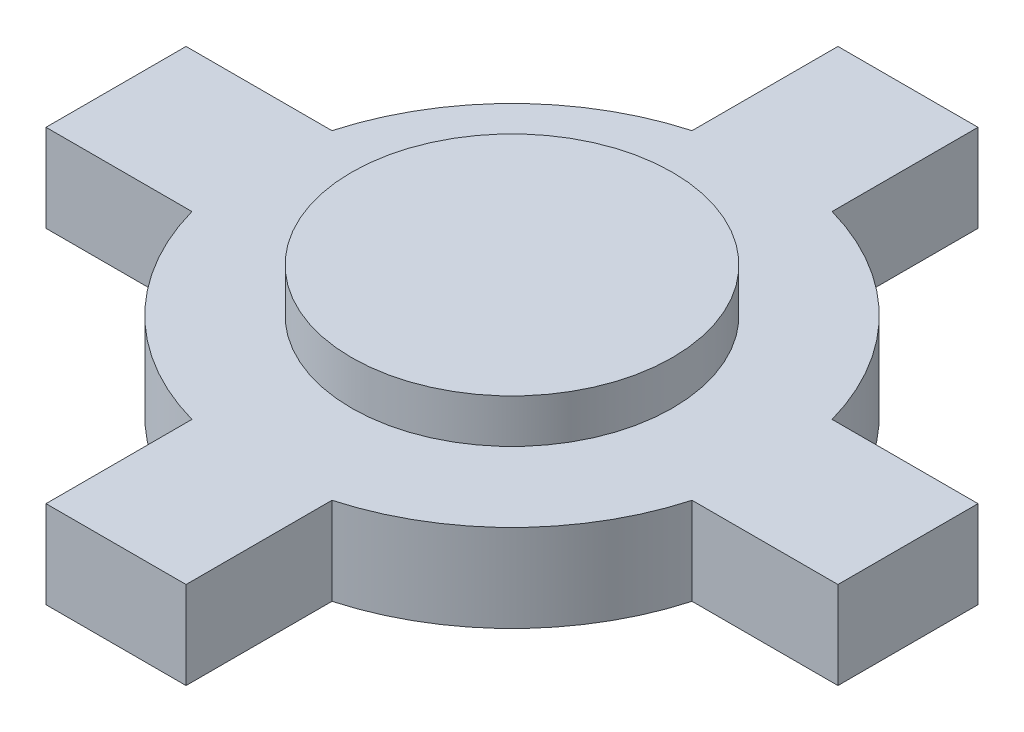
ISO-10303-21;
HEADER;
FILE_DESCRIPTION(('STEP AP214'),'2;1');
FILE_NAME('part.step','',(''),(''),'','','');
FILE_SCHEMA(('AUTOMOTIVE_DESIGN { 1 0 10303 214 1 1 1 1 }'));
ENDSEC;
DATA;
#1=APPLICATION_CONTEXT('core data for automotive mechanical design processes');
#2=APPLICATION_PROTOCOL_DEFINITION('international standard','automotive_design',2000,#1);
#3=PRODUCT_CONTEXT('',#1,'mechanical');
#4=PRODUCT('Part','Part','',(#3));
#5=PRODUCT_RELATED_PRODUCT_CATEGORY('part','',(#4));
#6=PRODUCT_DEFINITION_FORMATION('','',#4);
#7=PRODUCT_DEFINITION_CONTEXT('part definition',#1,'design');
#8=PRODUCT_DEFINITION('design','',#6,#7);
#9=PRODUCT_DEFINITION_SHAPE('','',#8);
#10=(LENGTH_UNIT() NAMED_UNIT(*) SI_UNIT(.MILLI.,.METRE.));
#11=(NAMED_UNIT(*) PLANE_ANGLE_UNIT() SI_UNIT($,.RADIAN.));
#12=(NAMED_UNIT(*) SI_UNIT($,.STERADIAN.) SOLID_ANGLE_UNIT());
#13=UNCERTAINTY_MEASURE_WITH_UNIT(LENGTH_MEASURE(1.E-05),#10,'distance_accuracy_value','');
#14=(GEOMETRIC_REPRESENTATION_CONTEXT(3) GLOBAL_UNCERTAINTY_ASSIGNED_CONTEXT((#13)) GLOBAL_UNIT_ASSIGNED_CONTEXT((#10,
#11,#12)) REPRESENTATION_CONTEXT('',''));
#15=CARTESIAN_POINT('',(0.,0.,0.));
#16=DIRECTION('',(0.,0.,1.));
#17=DIRECTION('',(1.,0.,0.));
#18=AXIS2_PLACEMENT_3D('',#15,#16,#17);
#19=CARTESIAN_POINT('',(-13.5702975444263,3.,-2.4));
#20=DIRECTION('',(1.,0.,0.));
#21=DIRECTION('',(0.,0.,-1.));
#22=AXIS2_PLACEMENT_3D('',#19,#20,#21);
#23=PLANE('',#22);
#24=DIRECTION('',(0.,0.,1.));
#25=VECTOR('',#24,1.);
#26=CARTESIAN_POINT('',(-13.5702975444263,0.,-2.4));
#27=LINE('',#26,#25);
#28=CARTESIAN_POINT('',(-13.5702975444263,0.,-2.4));
#29=VERTEX_POINT('',#28);
#30=CARTESIAN_POINT('',(-13.5702975444263,0.,2.4));
#31=VERTEX_POINT('',#30);
#32=EDGE_CURVE('E187',#29,#31,#27,.T.);
#33=ORIENTED_EDGE('',*,*,#32,.T.);
#34=DIRECTION('',(0.,-1.,0.));
#35=VECTOR('',#34,1.);
#36=CARTESIAN_POINT('',(-13.5702975444263,3.,2.4));
#37=LINE('',#36,#35);
#38=CARTESIAN_POINT('',(-13.5702975444263,3.,2.4));
#39=VERTEX_POINT('',#38);
#40=EDGE_CURVE('E44',#39,#31,#37,.T.);
#41=ORIENTED_EDGE('',*,*,#40,.F.);
#42=DIRECTION('',(0.,0.,1.));
#43=VECTOR('',#42,1.);
#44=CARTESIAN_POINT('',(-13.5702975444263,3.,-2.4));
#45=LINE('',#44,#43);
#46=CARTESIAN_POINT('',(-13.5702975444263,3.,-2.4));
#47=VERTEX_POINT('',#46);
#48=EDGE_CURVE('E218',#47,#39,#45,.T.);
#49=ORIENTED_EDGE('',*,*,#48,.F.);
#50=DIRECTION('',(0.,-1.,0.));
#51=VECTOR('',#50,1.);
#52=CARTESIAN_POINT('',(-13.5702975444263,3.,-2.4));
#53=LINE('',#52,#51);
#54=EDGE_CURVE('E183',#47,#29,#53,.T.);
#55=ORIENTED_EDGE('',*,*,#54,.T.);
#56=EDGE_LOOP('',(#33,#41,#49,#55));
#57=FACE_BOUND('',#56,.T.);
#58=ADVANCED_FACE('F41',(#57),#23,.F.);
#59=CARTESIAN_POINT('',(-13.5702975444263,3.,2.4));
#60=DIRECTION('',(0.,0.,-1.));
#61=DIRECTION('',(-1.,0.,0.));
#62=AXIS2_PLACEMENT_3D('',#59,#60,#61);
#63=PLANE('',#62);
#64=DIRECTION('',(1.,0.,0.));
#65=VECTOR('',#64,1.);
#66=CARTESIAN_POINT('',(-13.5702975444263,0.,2.4));
#67=LINE('',#66,#65);
#68=CARTESIAN_POINT('',(-8.57029754442633,0.,2.4));
#69=VERTEX_POINT('',#68);
#70=EDGE_CURVE('E190',#31,#69,#67,.T.);
#71=ORIENTED_EDGE('',*,*,#70,.T.);
#72=DIRECTION('',(0.,-1.,0.));
#73=VECTOR('',#72,1.);
#74=CARTESIAN_POINT('',(-8.57029754442633,3.,2.4));
#75=LINE('',#74,#73);
#76=CARTESIAN_POINT('',(-8.57029754442633,3.,2.4));
#77=VERTEX_POINT('',#76);
#78=EDGE_CURVE('E251',#77,#69,#75,.T.);
#79=ORIENTED_EDGE('',*,*,#78,.F.);
#80=DIRECTION('',(1.,0.,0.));
#81=VECTOR('',#80,1.);
#82=CARTESIAN_POINT('',(-13.5702975444263,3.,2.4));
#83=LINE('',#82,#81);
#84=EDGE_CURVE('E126',#39,#77,#83,.T.);
#85=ORIENTED_EDGE('',*,*,#84,.F.);
#86=ORIENTED_EDGE('',*,*,#40,.T.);
#87=EDGE_LOOP('',(#71,#79,#85,#86));
#88=FACE_BOUND('',#87,.T.);
#89=ADVANCED_FACE('F257',(#88),#63,.F.);
#90=CARTESIAN_POINT('',(0.,3.,0.));
#91=DIRECTION('',(0.,-1.,0.));
#92=DIRECTION('',(0.,0.,-1.));
#93=AXIS2_PLACEMENT_3D('',#90,#91,#92);
#94=CYLINDRICAL_SURFACE('',#93,8.9);
#95=CARTESIAN_POINT('',(0.,0.,0.));
#96=DIRECTION('',(0.,1.,0.));
#97=DIRECTION('',(0.,0.,1.));
#98=AXIS2_PLACEMENT_3D('',#95,#96,#97);
#99=CIRCLE('',#98,8.9);
#100=CARTESIAN_POINT('',(-2.39999999999999,0.,8.57029754442633));
#101=VERTEX_POINT('',#100);
#102=EDGE_CURVE('E193',#69,#101,#99,.T.);
#103=ORIENTED_EDGE('',*,*,#102,.T.);
#104=DIRECTION('',(0.,-1.,0.));
#105=VECTOR('',#104,1.);
#106=CARTESIAN_POINT('',(-2.39999999999999,3.,8.57029754442633));
#107=LINE('',#106,#105);
#108=CARTESIAN_POINT('',(-2.39999999999999,3.,8.57029754442633));
#109=VERTEX_POINT('',#108);
#110=EDGE_CURVE('E249',#109,#101,#107,.T.);
#111=ORIENTED_EDGE('',*,*,#110,.F.);
#112=CARTESIAN_POINT('',(0.,3.,0.));
#113=DIRECTION('',(0.,1.,0.));
#114=DIRECTION('',(0.,0.,1.));
#115=AXIS2_PLACEMENT_3D('',#112,#113,#114);
#116=CIRCLE('',#115,8.9);
#117=EDGE_CURVE('E274',#77,#109,#116,.T.);
#118=ORIENTED_EDGE('',*,*,#117,.F.);
#119=ORIENTED_EDGE('',*,*,#78,.T.);
#120=EDGE_LOOP('',(#103,#111,#118,#119));
#121=FACE_BOUND('',#120,.T.);
#122=ADVANCED_FACE('F266',(#121),#94,.T.);
#123=CARTESIAN_POINT('',(-2.39999999999999,3.,8.57029754442633));
#124=DIRECTION('',(1.,0.,0.));
#125=DIRECTION('',(0.,0.,-1.));
#126=AXIS2_PLACEMENT_3D('',#123,#124,#125);
#127=PLANE('',#126);
#128=DIRECTION('',(0.,0.,1.));
#129=VECTOR('',#128,1.);
#130=CARTESIAN_POINT('',(-2.39999999999999,0.,8.57029754442633));
#131=LINE('',#130,#129);
#132=CARTESIAN_POINT('',(-2.4,0.,13.5702975444263));
#133=VERTEX_POINT('',#132);
#134=EDGE_CURVE('E195',#101,#133,#131,.T.);
#135=ORIENTED_EDGE('',*,*,#134,.T.);
#136=DIRECTION('',(0.,-1.,0.));
#137=VECTOR('',#136,1.);
#138=CARTESIAN_POINT('',(-2.4,3.,13.5702975444263));
#139=LINE('',#138,#137);
#140=CARTESIAN_POINT('',(-2.4,3.,13.5702975444263));
#141=VERTEX_POINT('',#140);
#142=EDGE_CURVE('E246',#141,#133,#139,.T.);
#143=ORIENTED_EDGE('',*,*,#142,.F.);
#144=DIRECTION('',(0.,0.,1.));
#145=VECTOR('',#144,1.);
#146=CARTESIAN_POINT('',(-2.39999999999999,3.,8.57029754442633));
#147=LINE('',#146,#145);
#148=EDGE_CURVE('E271',#109,#141,#147,.T.);
#149=ORIENTED_EDGE('',*,*,#148,.F.);
#150=ORIENTED_EDGE('',*,*,#110,.T.);
#151=EDGE_LOOP('',(#135,#143,#149,#150));
#152=FACE_BOUND('',#151,.T.);
#153=ADVANCED_FACE('F269',(#152),#127,.F.);
#154=CARTESIAN_POINT('',(-2.4,3.,13.5702975444263));
#155=DIRECTION('',(0.,0.,-1.));
#156=DIRECTION('',(-1.,0.,0.));
#157=AXIS2_PLACEMENT_3D('',#154,#155,#156);
#158=PLANE('',#157);
#159=DIRECTION('',(1.,0.,0.));
#160=VECTOR('',#159,1.);
#161=CARTESIAN_POINT('',(-2.4,0.,13.5702975444263));
#162=LINE('',#161,#160);
#163=CARTESIAN_POINT('',(2.4,0.,13.5702975444263));
#164=VERTEX_POINT('',#163);
#165=EDGE_CURVE('E197',#133,#164,#162,.T.);
#166=ORIENTED_EDGE('',*,*,#165,.T.);
#167=DIRECTION('',(0.,-1.,0.));
#168=VECTOR('',#167,1.);
#169=CARTESIAN_POINT('',(2.4,3.,13.5702975444263));
#170=LINE('',#169,#168);
#171=CARTESIAN_POINT('',(2.4,3.,13.5702975444263));
#172=VERTEX_POINT('',#171);
#173=EDGE_CURVE('E243',#172,#164,#170,.T.);
#174=ORIENTED_EDGE('',*,*,#173,.F.);
#175=DIRECTION('',(1.,0.,0.));
#176=VECTOR('',#175,1.);
#177=CARTESIAN_POINT('',(-2.4,3.,13.5702975444263));
#178=LINE('',#177,#176);
#179=EDGE_CURVE('E273',#141,#172,#178,.T.);
#180=ORIENTED_EDGE('',*,*,#179,.F.);
#181=ORIENTED_EDGE('',*,*,#142,.T.);
#182=EDGE_LOOP('',(#166,#174,#180,#181));
#183=FACE_BOUND('',#182,.T.);
#184=ADVANCED_FACE('F333',(#183),#158,.F.);
#185=CARTESIAN_POINT('',(2.39999999999999,3.,8.57029754442633));
#186=DIRECTION('',(-1.,0.,0.));
#187=DIRECTION('',(0.,0.,1.));
#188=AXIS2_PLACEMENT_3D('',#185,#186,#187);
#189=PLANE('',#188);
#190=DIRECTION('',(0.,0.,-1.));
#191=VECTOR('',#190,1.);
#192=CARTESIAN_POINT('',(2.39999999999999,0.,8.57029754442633));
#193=LINE('',#192,#191);
#194=CARTESIAN_POINT('',(2.39999999999999,0.,8.57029754442633));
#195=VERTEX_POINT('',#194);
#196=EDGE_CURVE('E199',#164,#195,#193,.T.);
#197=ORIENTED_EDGE('',*,*,#196,.T.);
#198=DIRECTION('',(0.,-1.,0.));
#199=VECTOR('',#198,1.);
#200=CARTESIAN_POINT('',(2.39999999999999,3.,8.57029754442633));
#201=LINE('',#200,#199);
#202=CARTESIAN_POINT('',(2.39999999999999,3.,8.57029754442633));
#203=VERTEX_POINT('',#202);
#204=EDGE_CURVE('E240',#203,#195,#201,.T.);
#205=ORIENTED_EDGE('',*,*,#204,.F.);
#206=DIRECTION('',(0.,0.,-1.));
#207=VECTOR('',#206,1.);
#208=CARTESIAN_POINT('',(2.39999999999999,3.,8.57029754442633));
#209=LINE('',#208,#207);
#210=EDGE_CURVE('E276',#172,#203,#209,.T.);
#211=ORIENTED_EDGE('',*,*,#210,.F.);
#212=ORIENTED_EDGE('',*,*,#173,.T.);
#213=EDGE_LOOP('',(#197,#205,#211,#212));
#214=FACE_BOUND('',#213,.T.);
#215=ADVANCED_FACE('F330',(#214),#189,.F.);
#216=CARTESIAN_POINT('',(0.,3.,0.));
#217=DIRECTION('',(0.,-1.,0.));
#218=DIRECTION('',(0.,0.,-1.));
#219=AXIS2_PLACEMENT_3D('',#216,#217,#218);
#220=CYLINDRICAL_SURFACE('',#219,8.9);
#221=CARTESIAN_POINT('',(0.,0.,0.));
#222=DIRECTION('',(0.,1.,0.));
#223=DIRECTION('',(0.,0.,1.));
#224=AXIS2_PLACEMENT_3D('',#221,#222,#223);
#225=CIRCLE('',#224,8.9);
#226=CARTESIAN_POINT('',(8.57029754442633,0.,2.4));
#227=VERTEX_POINT('',#226);
#228=EDGE_CURVE('E201',#195,#227,#225,.T.);
#229=ORIENTED_EDGE('',*,*,#228,.T.);
#230=DIRECTION('',(0.,-1.,0.));
#231=VECTOR('',#230,1.);
#232=CARTESIAN_POINT('',(8.57029754442633,3.,2.4));
#233=LINE('',#232,#231);
#234=CARTESIAN_POINT('',(8.57029754442633,3.,2.4));
#235=VERTEX_POINT('',#234);
#236=EDGE_CURVE('E237',#235,#227,#233,.T.);
#237=ORIENTED_EDGE('',*,*,#236,.F.);
#238=CARTESIAN_POINT('',(0.,3.,0.));
#239=DIRECTION('',(0.,1.,0.));
#240=DIRECTION('',(0.,0.,1.));
#241=AXIS2_PLACEMENT_3D('',#238,#239,#240);
#242=CIRCLE('',#241,8.9);
#243=EDGE_CURVE('E282',#203,#235,#242,.T.);
#244=ORIENTED_EDGE('',*,*,#243,.F.);
#245=ORIENTED_EDGE('',*,*,#204,.T.);
#246=EDGE_LOOP('',(#229,#237,#244,#245));
#247=FACE_BOUND('',#246,.T.);
#248=ADVANCED_FACE('F326',(#247),#220,.T.);
#249=CARTESIAN_POINT('',(8.57029754442633,3.,2.4));
#250=DIRECTION('',(0.,0.,-1.));
#251=DIRECTION('',(-1.,0.,0.));
#252=AXIS2_PLACEMENT_3D('',#249,#250,#251);
#253=PLANE('',#252);
#254=DIRECTION('',(1.,0.,0.));
#255=VECTOR('',#254,1.);
#256=CARTESIAN_POINT('',(8.57029754442633,0.,2.4));
#257=LINE('',#256,#255);
#258=CARTESIAN_POINT('',(13.5702975444263,0.,2.4));
#259=VERTEX_POINT('',#258);
#260=EDGE_CURVE('E203',#227,#259,#257,.T.);
#261=ORIENTED_EDGE('',*,*,#260,.T.);
#262=DIRECTION('',(0.,-1.,0.));
#263=VECTOR('',#262,1.);
#264=CARTESIAN_POINT('',(13.5702975444263,3.,2.4));
#265=LINE('',#264,#263);
#266=CARTESIAN_POINT('',(13.5702975444263,3.,2.4));
#267=VERTEX_POINT('',#266);
#268=EDGE_CURVE('E234',#267,#259,#265,.T.);
#269=ORIENTED_EDGE('',*,*,#268,.F.);
#270=DIRECTION('',(1.,0.,0.));
#271=VECTOR('',#270,1.);
#272=CARTESIAN_POINT('',(8.57029754442633,3.,2.4));
#273=LINE('',#272,#271);
#274=EDGE_CURVE('E284',#235,#267,#273,.T.);
#275=ORIENTED_EDGE('',*,*,#274,.F.);
#276=ORIENTED_EDGE('',*,*,#236,.T.);
#277=EDGE_LOOP('',(#261,#269,#275,#276));
#278=FACE_BOUND('',#277,.T.);
#279=ADVANCED_FACE('F321',(#278),#253,.F.);
#280=CARTESIAN_POINT('',(13.5702975444263,3.,-2.4));
#281=DIRECTION('',(-1.,0.,0.));
#282=DIRECTION('',(0.,0.,1.));
#283=AXIS2_PLACEMENT_3D('',#280,#281,#282);
#284=PLANE('',#283);
#285=DIRECTION('',(0.,0.,-1.));
#286=VECTOR('',#285,1.);
#287=CARTESIAN_POINT('',(13.5702975444263,0.,-2.4));
#288=LINE('',#287,#286);
#289=CARTESIAN_POINT('',(13.5702975444263,0.,-2.4));
#290=VERTEX_POINT('',#289);
#291=EDGE_CURVE('E205',#259,#290,#288,.T.);
#292=ORIENTED_EDGE('',*,*,#291,.T.);
#293=DIRECTION('',(0.,-1.,0.));
#294=VECTOR('',#293,1.);
#295=CARTESIAN_POINT('',(13.5702975444263,3.,-2.4));
#296=LINE('',#295,#294);
#297=CARTESIAN_POINT('',(13.5702975444263,3.,-2.4));
#298=VERTEX_POINT('',#297);
#299=EDGE_CURVE('E231',#298,#290,#296,.T.);
#300=ORIENTED_EDGE('',*,*,#299,.F.);
#301=DIRECTION('',(0.,0.,-1.));
#302=VECTOR('',#301,1.);
#303=CARTESIAN_POINT('',(13.5702975444263,3.,-2.4));
#304=LINE('',#303,#302);
#305=EDGE_CURVE('E286',#267,#298,#304,.T.);
#306=ORIENTED_EDGE('',*,*,#305,.F.);
#307=ORIENTED_EDGE('',*,*,#268,.T.);
#308=EDGE_LOOP('',(#292,#300,#306,#307));
#309=FACE_BOUND('',#308,.T.);
#310=ADVANCED_FACE('F315',(#309),#284,.F.);
#311=CARTESIAN_POINT('',(8.57029754442633,3.,-2.4));
#312=DIRECTION('',(0.,0.,1.));
#313=DIRECTION('',(1.,0.,0.));
#314=AXIS2_PLACEMENT_3D('',#311,#312,#313);
#315=PLANE('',#314);
#316=DIRECTION('',(-1.,0.,0.));
#317=VECTOR('',#316,1.);
#318=CARTESIAN_POINT('',(8.57029754442633,0.,-2.4));
#319=LINE('',#318,#317);
#320=CARTESIAN_POINT('',(8.57029754442633,0.,-2.4));
#321=VERTEX_POINT('',#320);
#322=EDGE_CURVE('E207',#290,#321,#319,.T.);
#323=ORIENTED_EDGE('',*,*,#322,.T.);
#324=DIRECTION('',(0.,-1.,0.));
#325=VECTOR('',#324,1.);
#326=CARTESIAN_POINT('',(8.57029754442633,3.,-2.4));
#327=LINE('',#326,#325);
#328=CARTESIAN_POINT('',(8.57029754442633,3.,-2.4));
#329=VERTEX_POINT('',#328);
#330=EDGE_CURVE('E228',#329,#321,#327,.T.);
#331=ORIENTED_EDGE('',*,*,#330,.F.);
#332=DIRECTION('',(-1.,0.,0.));
#333=VECTOR('',#332,1.);
#334=CARTESIAN_POINT('',(8.57029754442633,3.,-2.4));
#335=LINE('',#334,#333);
#336=EDGE_CURVE('E288',#298,#329,#335,.T.);
#337=ORIENTED_EDGE('',*,*,#336,.F.);
#338=ORIENTED_EDGE('',*,*,#299,.T.);
#339=EDGE_LOOP('',(#323,#331,#337,#338));
#340=FACE_BOUND('',#339,.T.);
#341=ADVANCED_FACE('F311',(#340),#315,.F.);
#342=CARTESIAN_POINT('',(0.,3.,0.));
#343=DIRECTION('',(0.,-1.,0.));
#344=DIRECTION('',(0.,0.,-1.));
#345=AXIS2_PLACEMENT_3D('',#342,#343,#344);
#346=CYLINDRICAL_SURFACE('',#345,8.9);
#347=CARTESIAN_POINT('',(0.,0.,0.));
#348=DIRECTION('',(0.,1.,0.));
#349=DIRECTION('',(0.,0.,1.));
#350=AXIS2_PLACEMENT_3D('',#347,#348,#349);
#351=CIRCLE('',#350,8.9);
#352=CARTESIAN_POINT('',(2.4,0.,-8.57029754442633));
#353=VERTEX_POINT('',#352);
#354=EDGE_CURVE('E209',#321,#353,#351,.T.);
#355=ORIENTED_EDGE('',*,*,#354,.T.);
#356=DIRECTION('',(0.,-1.,0.));
#357=VECTOR('',#356,1.);
#358=CARTESIAN_POINT('',(2.4,3.,-8.57029754442633));
#359=LINE('',#358,#357);
#360=CARTESIAN_POINT('',(2.4,3.,-8.57029754442633));
#361=VERTEX_POINT('',#360);
#362=EDGE_CURVE('E225',#361,#353,#359,.T.);
#363=ORIENTED_EDGE('',*,*,#362,.F.);
#364=CARTESIAN_POINT('',(0.,3.,0.));
#365=DIRECTION('',(0.,1.,0.));
#366=DIRECTION('',(0.,0.,1.));
#367=AXIS2_PLACEMENT_3D('',#364,#365,#366);
#368=CIRCLE('',#367,8.9);
#369=EDGE_CURVE('E290',#329,#361,#368,.T.);
#370=ORIENTED_EDGE('',*,*,#369,.F.);
#371=ORIENTED_EDGE('',*,*,#330,.T.);
#372=EDGE_LOOP('',(#355,#363,#370,#371));
#373=FACE_BOUND('',#372,.T.);
#374=ADVANCED_FACE('F307',(#373),#346,.T.);
#375=CARTESIAN_POINT('',(2.4,3.,-13.5702975444263));
#376=DIRECTION('',(-1.,0.,0.));
#377=DIRECTION('',(0.,0.,1.));
#378=AXIS2_PLACEMENT_3D('',#375,#376,#377);
#379=PLANE('',#378);
#380=DIRECTION('',(0.,0.,-1.));
#381=VECTOR('',#380,1.);
#382=CARTESIAN_POINT('',(2.4,0.,-13.5702975444263));
#383=LINE('',#382,#381);
#384=CARTESIAN_POINT('',(2.4,0.,-13.5702975444263));
#385=VERTEX_POINT('',#384);
#386=EDGE_CURVE('E211',#353,#385,#383,.T.);
#387=ORIENTED_EDGE('',*,*,#386,.T.);
#388=DIRECTION('',(0.,-1.,0.));
#389=VECTOR('',#388,1.);
#390=CARTESIAN_POINT('',(2.4,3.,-13.5702975444263));
#391=LINE('',#390,#389);
#392=CARTESIAN_POINT('',(2.4,3.,-13.5702975444263));
#393=VERTEX_POINT('',#392);
#394=EDGE_CURVE('E222',#393,#385,#391,.T.);
#395=ORIENTED_EDGE('',*,*,#394,.F.);
#396=DIRECTION('',(0.,0.,-1.));
#397=VECTOR('',#396,1.);
#398=CARTESIAN_POINT('',(2.4,3.,-13.5702975444263));
#399=LINE('',#398,#397);
#400=EDGE_CURVE('E292',#361,#393,#399,.T.);
#401=ORIENTED_EDGE('',*,*,#400,.F.);
#402=ORIENTED_EDGE('',*,*,#362,.T.);
#403=EDGE_LOOP('',(#387,#395,#401,#402));
#404=FACE_BOUND('',#403,.T.);
#405=ADVANCED_FACE('F298',(#404),#379,.F.);
#406=CARTESIAN_POINT('',(-2.4,3.,-13.5702975444263));
#407=DIRECTION('',(0.,0.,1.));
#408=DIRECTION('',(1.,0.,0.));
#409=AXIS2_PLACEMENT_3D('',#406,#407,#408);
#410=PLANE('',#409);
#411=DIRECTION('',(-1.,0.,0.));
#412=VECTOR('',#411,1.);
#413=CARTESIAN_POINT('',(-2.4,0.,-13.5702975444263));
#414=LINE('',#413,#412);
#415=CARTESIAN_POINT('',(-2.4,0.,-13.5702975444263));
#416=VERTEX_POINT('',#415);
#417=EDGE_CURVE('E213',#385,#416,#414,.T.);
#418=ORIENTED_EDGE('',*,*,#417,.T.);
#419=DIRECTION('',(0.,-1.,0.));
#420=VECTOR('',#419,1.);
#421=CARTESIAN_POINT('',(-2.4,3.,-13.5702975444263));
#422=LINE('',#421,#420);
#423=CARTESIAN_POINT('',(-2.4,3.,-13.5702975444263));
#424=VERTEX_POINT('',#423);
#425=EDGE_CURVE('E178',#424,#416,#422,.T.);
#426=ORIENTED_EDGE('',*,*,#425,.F.);
#427=DIRECTION('',(-1.,0.,0.));
#428=VECTOR('',#427,1.);
#429=CARTESIAN_POINT('',(-2.4,3.,-13.5702975444263));
#430=LINE('',#429,#428);
#431=EDGE_CURVE('E169',#393,#424,#430,.T.);
#432=ORIENTED_EDGE('',*,*,#431,.F.);
#433=ORIENTED_EDGE('',*,*,#394,.T.);
#434=EDGE_LOOP('',(#418,#426,#432,#433));
#435=FACE_BOUND('',#434,.T.);
#436=ADVANCED_FACE('F302',(#435),#410,.F.);
#437=CARTESIAN_POINT('',(-2.4,3.,-13.5702975444263));
#438=DIRECTION('',(1.,0.,0.));
#439=DIRECTION('',(0.,0.,-1.));
#440=AXIS2_PLACEMENT_3D('',#437,#438,#439);
#441=PLANE('',#440);
#442=DIRECTION('',(0.,0.,1.));
#443=VECTOR('',#442,1.);
#444=CARTESIAN_POINT('',(-2.4,0.,-13.5702975444263));
#445=LINE('',#444,#443);
#446=CARTESIAN_POINT('',(-2.4,0.,-8.57029754442633));
#447=VERTEX_POINT('',#446);
#448=EDGE_CURVE('E177',#416,#447,#445,.T.);
#449=ORIENTED_EDGE('',*,*,#448,.T.);
#450=DIRECTION('',(0.,-1.,0.));
#451=VECTOR('',#450,1.);
#452=CARTESIAN_POINT('',(-2.4,3.,-8.57029754442633));
#453=LINE('',#452,#451);
#454=CARTESIAN_POINT('',(-2.4,3.,-8.57029754442633));
#455=VERTEX_POINT('',#454);
#456=EDGE_CURVE('E174',#455,#447,#453,.T.);
#457=ORIENTED_EDGE('',*,*,#456,.F.);
#458=DIRECTION('',(0.,0.,1.));
#459=VECTOR('',#458,1.);
#460=CARTESIAN_POINT('',(-2.4,3.,-13.5702975444263));
#461=LINE('',#460,#459);
#462=EDGE_CURVE('E163',#424,#455,#461,.T.);
#463=ORIENTED_EDGE('',*,*,#462,.F.);
#464=ORIENTED_EDGE('',*,*,#425,.T.);
#465=EDGE_LOOP('',(#449,#457,#463,#464));
#466=FACE_BOUND('',#465,.T.);
#467=ADVANCED_FACE('F175',(#466),#441,.F.);
#468=CARTESIAN_POINT('',(0.,3.,0.));
#469=DIRECTION('',(0.,-1.,0.));
#470=DIRECTION('',(0.,0.,-1.));
#471=AXIS2_PLACEMENT_3D('',#468,#469,#470);
#472=CYLINDRICAL_SURFACE('',#471,8.9);
#473=CARTESIAN_POINT('',(0.,0.,0.));
#474=DIRECTION('',(0.,1.,0.));
#475=DIRECTION('',(0.,0.,1.));
#476=AXIS2_PLACEMENT_3D('',#473,#474,#475);
#477=CIRCLE('',#476,8.9);
#478=CARTESIAN_POINT('',(-8.57029754442633,0.,-2.4));
#479=VERTEX_POINT('',#478);
#480=EDGE_CURVE('E111',#447,#479,#477,.T.);
#481=ORIENTED_EDGE('',*,*,#480,.T.);
#482=DIRECTION('',(0.,-1.,0.));
#483=VECTOR('',#482,1.);
#484=CARTESIAN_POINT('',(-8.57029754442633,3.,-2.4));
#485=LINE('',#484,#483);
#486=CARTESIAN_POINT('',(-8.57029754442633,3.,-2.4));
#487=VERTEX_POINT('',#486);
#488=EDGE_CURVE('E179',#487,#479,#485,.T.);
#489=ORIENTED_EDGE('',*,*,#488,.F.);
#490=CARTESIAN_POINT('',(0.,3.,0.));
#491=DIRECTION('',(0.,1.,0.));
#492=DIRECTION('',(0.,0.,1.));
#493=AXIS2_PLACEMENT_3D('',#490,#491,#492);
#494=CIRCLE('',#493,8.9);
#495=EDGE_CURVE('E167',#455,#487,#494,.T.);
#496=ORIENTED_EDGE('',*,*,#495,.F.);
#497=ORIENTED_EDGE('',*,*,#456,.T.);
#498=EDGE_LOOP('',(#481,#489,#496,#497));
#499=FACE_BOUND('',#498,.T.);
#500=ADVANCED_FACE('F181',(#499),#472,.T.);
#501=CARTESIAN_POINT('',(-13.5702975444263,3.,-2.4));
#502=DIRECTION('',(0.,0.,1.));
#503=DIRECTION('',(1.,0.,0.));
#504=AXIS2_PLACEMENT_3D('',#501,#502,#503);
#505=PLANE('',#504);
#506=DIRECTION('',(-1.,0.,0.));
#507=VECTOR('',#506,1.);
#508=CARTESIAN_POINT('',(-13.5702975444263,0.,-2.4));
#509=LINE('',#508,#507);
#510=EDGE_CURVE('E117',#479,#29,#509,.T.);
#511=ORIENTED_EDGE('',*,*,#510,.T.);
#512=ORIENTED_EDGE('',*,*,#54,.F.);
#513=DIRECTION('',(-1.,0.,0.));
#514=VECTOR('',#513,1.);
#515=CARTESIAN_POINT('',(-13.5702975444263,3.,-2.4));
#516=LINE('',#515,#514);
#517=EDGE_CURVE('E58',#487,#47,#516,.T.);
#518=ORIENTED_EDGE('',*,*,#517,.F.);
#519=ORIENTED_EDGE('',*,*,#488,.T.);
#520=EDGE_LOOP('',(#511,#512,#518,#519));
#521=FACE_BOUND('',#520,.T.);
#522=ADVANCED_FACE('F417',(#521),#505,.F.);
#523=CARTESIAN_POINT('',(0.,3.,0.));
#524=DIRECTION('',(0.,1.,0.));
#525=DIRECTION('',(0.,0.,1.));
#526=AXIS2_PLACEMENT_3D('',#523,#524,#525);
#527=PLANE('',#526);
#528=CARTESIAN_POINT('',(0.,3.,0.));
#529=DIRECTION('',(0.,1.,0.));
#530=DIRECTION('',(0.,0.,1.));
#531=AXIS2_PLACEMENT_3D('',#528,#529,#530);
#532=CIRCLE('',#531,5.5);
#533=CARTESIAN_POINT('',(0.,3.,5.5));
#534=VERTEX_POINT('',#533);
#535=EDGE_CURVE('E11',#534,#534,#532,.T.);
#536=ORIENTED_EDGE('',*,*,#535,.F.);
#537=EDGE_LOOP('',(#536));
#538=FACE_BOUND('',#537,.T.);
#539=ORIENTED_EDGE('',*,*,#48,.T.);
#540=ORIENTED_EDGE('',*,*,#84,.T.);
#541=ORIENTED_EDGE('',*,*,#117,.T.);
#542=ORIENTED_EDGE('',*,*,#148,.T.);
#543=ORIENTED_EDGE('',*,*,#179,.T.);
#544=ORIENTED_EDGE('',*,*,#210,.T.);
#545=ORIENTED_EDGE('',*,*,#243,.T.);
#546=ORIENTED_EDGE('',*,*,#274,.T.);
#547=ORIENTED_EDGE('',*,*,#305,.T.);
#548=ORIENTED_EDGE('',*,*,#336,.T.);
#549=ORIENTED_EDGE('',*,*,#369,.T.);
#550=ORIENTED_EDGE('',*,*,#400,.T.);
#551=ORIENTED_EDGE('',*,*,#431,.T.);
#552=ORIENTED_EDGE('',*,*,#462,.T.);
#553=ORIENTED_EDGE('',*,*,#495,.T.);
#554=ORIENTED_EDGE('',*,*,#517,.T.);
#555=EDGE_LOOP('',(#539,#540,#541,#542,#543,#544,#545,#546,#547,#548,#549,#550,#551,#552,#553,#554));
#556=FACE_BOUND('',#555,.T.);
#557=ADVANCED_FACE('F165',(#538,#556),#527,.T.);
#558=CARTESIAN_POINT('',(0.,0.,0.));
#559=DIRECTION('',(0.,1.,0.));
#560=DIRECTION('',(0.,0.,1.));
#561=AXIS2_PLACEMENT_3D('',#558,#559,#560);
#562=PLANE('',#561);
#563=ORIENTED_EDGE('',*,*,#32,.F.);
#564=ORIENTED_EDGE('',*,*,#510,.F.);
#565=ORIENTED_EDGE('',*,*,#480,.F.);
#566=ORIENTED_EDGE('',*,*,#448,.F.);
#567=ORIENTED_EDGE('',*,*,#417,.F.);
#568=ORIENTED_EDGE('',*,*,#386,.F.);
#569=ORIENTED_EDGE('',*,*,#354,.F.);
#570=ORIENTED_EDGE('',*,*,#322,.F.);
#571=ORIENTED_EDGE('',*,*,#291,.F.);
#572=ORIENTED_EDGE('',*,*,#260,.F.);
#573=ORIENTED_EDGE('',*,*,#228,.F.);
#574=ORIENTED_EDGE('',*,*,#196,.F.);
#575=ORIENTED_EDGE('',*,*,#165,.F.);
#576=ORIENTED_EDGE('',*,*,#134,.F.);
#577=ORIENTED_EDGE('',*,*,#102,.F.);
#578=ORIENTED_EDGE('',*,*,#70,.F.);
#579=EDGE_LOOP('',(#563,#564,#565,#566,#567,#568,#569,#570,#571,#572,#573,#574,#575,#576,#577,#578));
#580=FACE_BOUND('',#579,.T.);
#581=ADVANCED_FACE('F262',(#580),#562,.F.);
#582=CARTESIAN_POINT('',(0.,4.5,0.));
#583=DIRECTION('',(0.,-1.,0.));
#584=DIRECTION('',(0.,0.,-1.));
#585=AXIS2_PLACEMENT_3D('',#582,#583,#584);
#586=CYLINDRICAL_SURFACE('',#585,5.5);
#587=CARTESIAN_POINT('',(0.,4.5,0.));
#588=DIRECTION('',(0.,1.,0.));
#589=DIRECTION('',(0.,0.,1.));
#590=AXIS2_PLACEMENT_3D('',#587,#588,#589);
#591=CIRCLE('',#590,5.5);
#592=CARTESIAN_POINT('',(0.,4.5,5.5));
#593=VERTEX_POINT('',#592);
#594=EDGE_CURVE('E191',#593,#593,#591,.T.);
#595=ORIENTED_EDGE('',*,*,#594,.F.);
#596=EDGE_LOOP('',(#595));
#597=FACE_BOUND('',#596,.T.);
#598=ORIENTED_EDGE('',*,*,#535,.T.);
#599=EDGE_LOOP('',(#598));
#600=FACE_BOUND('',#599,.T.);
#601=ADVANCED_FACE('F438',(#597,#600),#586,.T.);
#602=CARTESIAN_POINT('',(0.,4.5,0.));
#603=DIRECTION('',(0.,1.,0.));
#604=DIRECTION('',(0.,0.,1.));
#605=AXIS2_PLACEMENT_3D('',#602,#603,#604);
#606=PLANE('',#605);
#607=ORIENTED_EDGE('',*,*,#594,.T.);
#608=EDGE_LOOP('',(#607));
#609=FACE_BOUND('',#608,.T.);
#610=ADVANCED_FACE('F445',(#609),#606,.T.);
#611=CLOSED_SHELL('',(#58,#89,#122,#153,#184,#215,#248,#279,#310,#341,#374,#405,#436,#467,#500,
#522,#557,#581,#601,#610));
#612=MANIFOLD_SOLID_BREP('B2',#611);
#613=ADVANCED_BREP_SHAPE_REPRESENTATION('',(#18,#612),#14);
#614=SHAPE_DEFINITION_REPRESENTATION(#9,#613);
ENDSEC;
END-ISO-10303-21;
